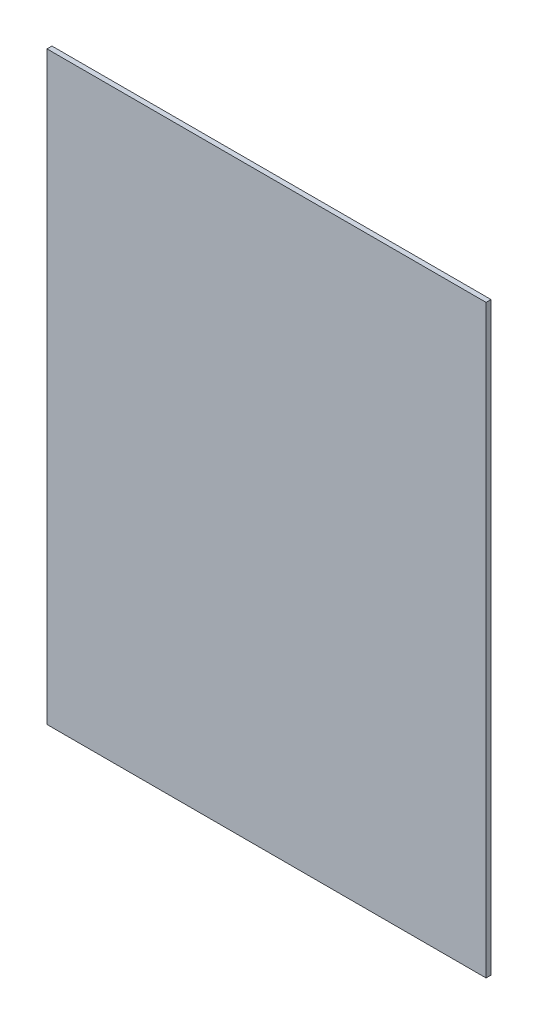
ISO-10303-21;
HEADER;
FILE_DESCRIPTION(('STEP AP214'),'2;1');
FILE_NAME('part.step','',(''),(''),'','','');
FILE_SCHEMA(('AUTOMOTIVE_DESIGN { 1 0 10303 214 1 1 1 1 }'));
ENDSEC;
DATA;
#1=APPLICATION_CONTEXT('core data for automotive mechanical design processes');
#2=APPLICATION_PROTOCOL_DEFINITION('international standard','automotive_design',2000,#1);
#3=PRODUCT_CONTEXT('',#1,'mechanical');
#4=PRODUCT('Part','Part','',(#3));
#5=PRODUCT_RELATED_PRODUCT_CATEGORY('part','',(#4));
#6=PRODUCT_DEFINITION_FORMATION('','',#4);
#7=PRODUCT_DEFINITION_CONTEXT('part definition',#1,'design');
#8=PRODUCT_DEFINITION('design','',#6,#7);
#9=PRODUCT_DEFINITION_SHAPE('','',#8);
#10=(LENGTH_UNIT() NAMED_UNIT(*) SI_UNIT(.MILLI.,.METRE.));
#11=(NAMED_UNIT(*) PLANE_ANGLE_UNIT() SI_UNIT($,.RADIAN.));
#12=(NAMED_UNIT(*) SI_UNIT($,.STERADIAN.) SOLID_ANGLE_UNIT());
#13=UNCERTAINTY_MEASURE_WITH_UNIT(LENGTH_MEASURE(1.E-05),#10,'distance_accuracy_value','');
#14=(GEOMETRIC_REPRESENTATION_CONTEXT(3) GLOBAL_UNCERTAINTY_ASSIGNED_CONTEXT((#13)) GLOBAL_UNIT_ASSIGNED_CONTEXT((#10,
#11,#12)) REPRESENTATION_CONTEXT('',''));
#15=CARTESIAN_POINT('',(0.,0.,0.));
#16=DIRECTION('',(0.,0.,1.));
#17=DIRECTION('',(1.,0.,0.));
#18=AXIS2_PLACEMENT_3D('',#15,#16,#17);
#19=CARTESIAN_POINT('',(0.,0.,1.));
#20=DIRECTION('',(1.,0.,0.));
#21=DIRECTION('',(0.,0.,-1.));
#22=AXIS2_PLACEMENT_3D('',#19,#20,#21);
#23=PLANE('',#22);
#24=DIRECTION('',(0.,-1.,0.));
#25=VECTOR('',#24,1.);
#26=CARTESIAN_POINT('',(0.,0.,0.));
#27=LINE('',#26,#25);
#28=CARTESIAN_POINT('',(0.,118.2,0.));
#29=VERTEX_POINT('',#28);
#30=CARTESIAN_POINT('',(0.,0.,0.));
#31=VERTEX_POINT('',#30);
#32=EDGE_CURVE('E95',#29,#31,#27,.T.);
#33=ORIENTED_EDGE('',*,*,#32,.T.);
#34=DIRECTION('',(0.,0.,-1.));
#35=VECTOR('',#34,1.);
#36=CARTESIAN_POINT('',(0.,0.,1.));
#37=LINE('',#36,#35);
#38=CARTESIAN_POINT('',(0.,0.,1.));
#39=VERTEX_POINT('',#38);
#40=EDGE_CURVE('E11',#39,#31,#37,.T.);
#41=ORIENTED_EDGE('',*,*,#40,.F.);
#42=DIRECTION('',(0.,-1.,0.));
#43=VECTOR('',#42,1.);
#44=CARTESIAN_POINT('',(0.,0.,1.));
#45=LINE('',#44,#43);
#46=CARTESIAN_POINT('',(0.,118.2,1.));
#47=VERTEX_POINT('',#46);
#48=EDGE_CURVE('E83',#47,#39,#45,.T.);
#49=ORIENTED_EDGE('',*,*,#48,.F.);
#50=DIRECTION('',(0.,0.,-1.));
#51=VECTOR('',#50,1.);
#52=CARTESIAN_POINT('',(0.,118.2,1.));
#53=LINE('',#52,#51);
#54=EDGE_CURVE('E91',#47,#29,#53,.T.);
#55=ORIENTED_EDGE('',*,*,#54,.T.);
#56=EDGE_LOOP('',(#33,#41,#49,#55));
#57=FACE_BOUND('',#56,.T.);
#58=ADVANCED_FACE('F32',(#57),#23,.F.);
#59=CARTESIAN_POINT('',(0.,0.,1.));
#60=DIRECTION('',(0.,1.,0.));
#61=DIRECTION('',(0.,0.,1.));
#62=AXIS2_PLACEMENT_3D('',#59,#60,#61);
#63=PLANE('',#62);
#64=DIRECTION('',(1.,0.,0.));
#65=VECTOR('',#64,1.);
#66=CARTESIAN_POINT('',(0.,0.,0.));
#67=LINE('',#66,#65);
#68=CARTESIAN_POINT('',(88.7,0.,0.));
#69=VERTEX_POINT('',#68);
#70=EDGE_CURVE('E87',#31,#69,#67,.T.);
#71=ORIENTED_EDGE('',*,*,#70,.T.);
#72=DIRECTION('',(0.,0.,-1.));
#73=VECTOR('',#72,1.);
#74=CARTESIAN_POINT('',(88.7,0.,1.));
#75=LINE('',#74,#73);
#76=CARTESIAN_POINT('',(88.7,0.,1.));
#77=VERTEX_POINT('',#76);
#78=EDGE_CURVE('E40',#77,#69,#75,.T.);
#79=ORIENTED_EDGE('',*,*,#78,.F.);
#80=DIRECTION('',(1.,0.,0.));
#81=VECTOR('',#80,1.);
#82=CARTESIAN_POINT('',(0.,0.,1.));
#83=LINE('',#82,#81);
#84=EDGE_CURVE('E78',#39,#77,#83,.T.);
#85=ORIENTED_EDGE('',*,*,#84,.F.);
#86=ORIENTED_EDGE('',*,*,#40,.T.);
#87=EDGE_LOOP('',(#71,#79,#85,#86));
#88=FACE_BOUND('',#87,.T.);
#89=ADVANCED_FACE('F86',(#88),#63,.F.);
#90=CARTESIAN_POINT('',(88.7,0.,1.));
#91=DIRECTION('',(-1.,0.,0.));
#92=DIRECTION('',(0.,0.,1.));
#93=AXIS2_PLACEMENT_3D('',#90,#91,#92);
#94=PLANE('',#93);
#95=DIRECTION('',(0.,1.,0.));
#96=VECTOR('',#95,1.);
#97=CARTESIAN_POINT('',(88.7,0.,0.));
#98=LINE('',#97,#96);
#99=CARTESIAN_POINT('',(88.7,118.2,0.));
#100=VERTEX_POINT('',#99);
#101=EDGE_CURVE('E65',#69,#100,#98,.T.);
#102=ORIENTED_EDGE('',*,*,#101,.T.);
#103=DIRECTION('',(0.,0.,-1.));
#104=VECTOR('',#103,1.);
#105=CARTESIAN_POINT('',(88.7,118.2,1.));
#106=LINE('',#105,#104);
#107=CARTESIAN_POINT('',(88.7,118.2,1.));
#108=VERTEX_POINT('',#107);
#109=EDGE_CURVE('E88',#108,#100,#106,.T.);
#110=ORIENTED_EDGE('',*,*,#109,.F.);
#111=DIRECTION('',(0.,1.,0.));
#112=VECTOR('',#111,1.);
#113=CARTESIAN_POINT('',(88.7,0.,1.));
#114=LINE('',#113,#112);
#115=EDGE_CURVE('E81',#77,#108,#114,.T.);
#116=ORIENTED_EDGE('',*,*,#115,.F.);
#117=ORIENTED_EDGE('',*,*,#78,.T.);
#118=EDGE_LOOP('',(#102,#110,#116,#117));
#119=FACE_BOUND('',#118,.T.);
#120=ADVANCED_FACE('F89',(#119),#94,.F.);
#121=CARTESIAN_POINT('',(0.,118.2,1.));
#122=DIRECTION('',(0.,-1.,0.));
#123=DIRECTION('',(0.,0.,-1.));
#124=AXIS2_PLACEMENT_3D('',#121,#122,#123);
#125=PLANE('',#124);
#126=DIRECTION('',(-1.,0.,0.));
#127=VECTOR('',#126,1.);
#128=CARTESIAN_POINT('',(0.,118.2,0.));
#129=LINE('',#128,#127);
#130=EDGE_CURVE('E71',#100,#29,#129,.T.);
#131=ORIENTED_EDGE('',*,*,#130,.T.);
#132=ORIENTED_EDGE('',*,*,#54,.F.);
#133=DIRECTION('',(-1.,0.,0.));
#134=VECTOR('',#133,1.);
#135=CARTESIAN_POINT('',(0.,118.2,1.));
#136=LINE('',#135,#134);
#137=EDGE_CURVE('E48',#108,#47,#136,.T.);
#138=ORIENTED_EDGE('',*,*,#137,.F.);
#139=ORIENTED_EDGE('',*,*,#109,.T.);
#140=EDGE_LOOP('',(#131,#132,#138,#139));
#141=FACE_BOUND('',#140,.T.);
#142=ADVANCED_FACE('F102',(#141),#125,.F.);
#143=CARTESIAN_POINT('',(0.,0.,1.));
#144=DIRECTION('',(0.,0.,-1.));
#145=DIRECTION('',(-1.,0.,0.));
#146=AXIS2_PLACEMENT_3D('',#143,#144,#145);
#147=PLANE('',#146);
#148=ORIENTED_EDGE('',*,*,#48,.T.);
#149=ORIENTED_EDGE('',*,*,#84,.T.);
#150=ORIENTED_EDGE('',*,*,#115,.T.);
#151=ORIENTED_EDGE('',*,*,#137,.T.);
#152=EDGE_LOOP('',(#148,#149,#150,#151));
#153=FACE_BOUND('',#152,.T.);
#154=ADVANCED_FACE('F79',(#153),#147,.F.);
#155=CARTESIAN_POINT('',(0.,0.,0.));
#156=DIRECTION('',(0.,0.,-1.));
#157=DIRECTION('',(-1.,0.,0.));
#158=AXIS2_PLACEMENT_3D('',#155,#156,#157);
#159=PLANE('',#158);
#160=ORIENTED_EDGE('',*,*,#32,.F.);
#161=ORIENTED_EDGE('',*,*,#130,.F.);
#162=ORIENTED_EDGE('',*,*,#101,.F.);
#163=ORIENTED_EDGE('',*,*,#70,.F.);
#164=EDGE_LOOP('',(#160,#161,#162,#163));
#165=FACE_BOUND('',#164,.T.);
#166=ADVANCED_FACE('F105',(#165),#159,.T.);
#167=CLOSED_SHELL('',(#58,#89,#120,#142,#154,#166));
#168=MANIFOLD_SOLID_BREP('B2',#167);
#169=ADVANCED_BREP_SHAPE_REPRESENTATION('',(#18,#168),#14);
#170=SHAPE_DEFINITION_REPRESENTATION(#9,#169);
ENDSEC;
END-ISO-10303-21;
